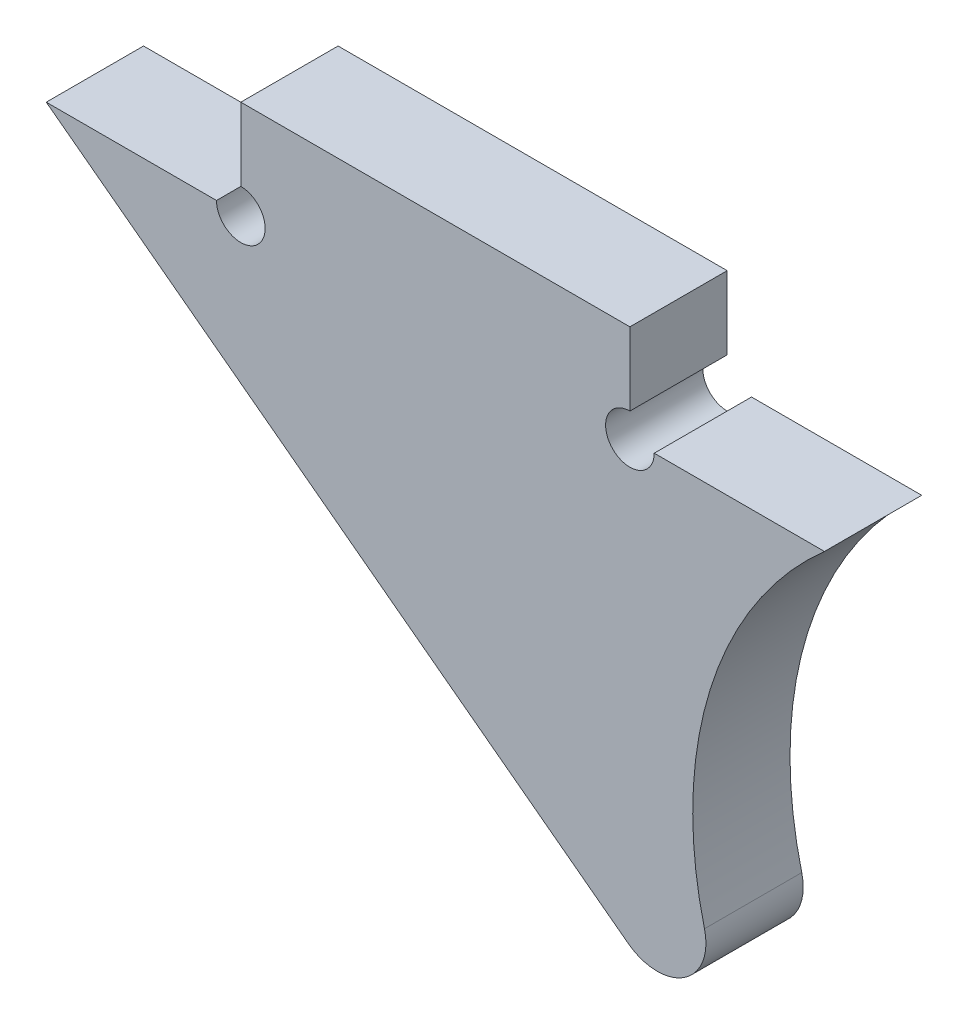
ISO-10303-21;
HEADER;
FILE_DESCRIPTION(('STEP AP214'),'2;1');
FILE_NAME('part.step','',(''),(''),'','','');
FILE_SCHEMA(('AUTOMOTIVE_DESIGN { 1 0 10303 214 1 1 1 1 }'));
ENDSEC;
DATA;
#1=APPLICATION_CONTEXT('core data for automotive mechanical design processes');
#2=APPLICATION_PROTOCOL_DEFINITION('international standard','automotive_design',2000,#1);
#3=PRODUCT_CONTEXT('',#1,'mechanical');
#4=PRODUCT('Part','Part','',(#3));
#5=PRODUCT_RELATED_PRODUCT_CATEGORY('part','',(#4));
#6=PRODUCT_DEFINITION_FORMATION('','',#4);
#7=PRODUCT_DEFINITION_CONTEXT('part definition',#1,'design');
#8=PRODUCT_DEFINITION('design','',#6,#7);
#9=PRODUCT_DEFINITION_SHAPE('','',#8);
#10=(LENGTH_UNIT() NAMED_UNIT(*) SI_UNIT(.MILLI.,.METRE.));
#11=(NAMED_UNIT(*) PLANE_ANGLE_UNIT() SI_UNIT($,.RADIAN.));
#12=(NAMED_UNIT(*) SI_UNIT($,.STERADIAN.) SOLID_ANGLE_UNIT());
#13=UNCERTAINTY_MEASURE_WITH_UNIT(LENGTH_MEASURE(1.E-05),#10,'distance_accuracy_value','');
#14=(GEOMETRIC_REPRESENTATION_CONTEXT(3) GLOBAL_UNCERTAINTY_ASSIGNED_CONTEXT((#13)) GLOBAL_UNIT_ASSIGNED_CONTEXT((#10,
#11,#12)) REPRESENTATION_CONTEXT('',''));
#15=CARTESIAN_POINT('',(0.,0.,0.));
#16=DIRECTION('',(0.,0.,1.));
#17=DIRECTION('',(1.,0.,0.));
#18=AXIS2_PLACEMENT_3D('',#15,#16,#17);
#19=CARTESIAN_POINT('',(-6.35000000000017,0.,37.9156776553178));
#20=DIRECTION('',(-1.,0.,0.));
#21=DIRECTION('',(0.,0.,1.));
#22=AXIS2_PLACEMENT_3D('',#19,#20,#21);
#23=PLANE('',#22);
#24=DIRECTION('',(0.,1.,0.));
#25=VECTOR('',#24,1.);
#26=CARTESIAN_POINT('',(-6.35000000000017,0.,3.17499999999998));
#27=LINE('',#26,#25);
#28=CARTESIAN_POINT('',(-6.35000000000017,0.79375,3.17499999999998));
#29=VERTEX_POINT('',#28);
#30=CARTESIAN_POINT('',(-6.35000000000017,3.175,3.17499999999999));
#31=VERTEX_POINT('',#30);
#32=EDGE_CURVE('E133',#29,#31,#27,.T.);
#33=ORIENTED_EDGE('',*,*,#32,.F.);
#34=DIRECTION('',(0.,0.,1.));
#35=VECTOR('',#34,1.);
#36=CARTESIAN_POINT('',(-6.35000000000017,0.79375,-2.24506403026729));
#37=LINE('',#36,#35);
#38=CARTESIAN_POINT('',(-6.35000000000017,0.79375,0.));
#39=VERTEX_POINT('',#38);
#40=EDGE_CURVE('E55',#29,#39,#37,.F.);
#41=ORIENTED_EDGE('',*,*,#40,.T.);
#42=DIRECTION('',(0.,1.,0.));
#43=VECTOR('',#42,1.);
#44=CARTESIAN_POINT('',(-6.35000000000017,0.,0.));
#45=LINE('',#44,#43);
#46=CARTESIAN_POINT('',(-6.35000000000017,3.175,0.));
#47=VERTEX_POINT('',#46);
#48=EDGE_CURVE('E125',#39,#47,#45,.T.);
#49=ORIENTED_EDGE('',*,*,#48,.T.);
#50=DIRECTION('',(0.,0.,-1.));
#51=VECTOR('',#50,1.);
#52=CARTESIAN_POINT('',(-6.35000000000017,3.175,37.9156776553178));
#53=LINE('',#52,#51);
#54=EDGE_CURVE('E155',#31,#47,#53,.T.);
#55=ORIENTED_EDGE('',*,*,#54,.F.);
#56=EDGE_LOOP('',(#33,#41,#49,#55));
#57=FACE_BOUND('',#56,.T.);
#58=ADVANCED_FACE('F33',(#57),#23,.F.);
#59=CARTESIAN_POINT('',(-6.35000000000017,3.175,37.9156776553178));
#60=DIRECTION('',(0.,-1.,0.));
#61=DIRECTION('',(0.,0.,-1.));
#62=AXIS2_PLACEMENT_3D('',#59,#60,#61);
#63=PLANE('',#62);
#64=DIRECTION('',(-1.,0.,0.));
#65=VECTOR('',#64,1.);
#66=CARTESIAN_POINT('',(-6.35000000000021,3.175,3.17499999999998));
#67=LINE('',#66,#65);
#68=CARTESIAN_POINT('',(-19.0500000000002,3.175,3.175));
#69=VERTEX_POINT('',#68);
#70=EDGE_CURVE('E168',#31,#69,#67,.T.);
#71=ORIENTED_EDGE('',*,*,#70,.F.);
#72=ORIENTED_EDGE('',*,*,#54,.T.);
#73=DIRECTION('',(-1.,0.,0.));
#74=VECTOR('',#73,1.);
#75=CARTESIAN_POINT('',(-6.35000000000017,3.175,0.));
#76=LINE('',#75,#74);
#77=CARTESIAN_POINT('',(-19.0500000000002,3.175,0.));
#78=VERTEX_POINT('',#77);
#79=EDGE_CURVE('E152',#47,#78,#76,.T.);
#80=ORIENTED_EDGE('',*,*,#79,.T.);
#81=DIRECTION('',(0.,0.,-1.));
#82=VECTOR('',#81,1.);
#83=CARTESIAN_POINT('',(-19.0500000000002,3.175,37.9156776553178));
#84=LINE('',#83,#82);
#85=EDGE_CURVE('E151',#69,#78,#84,.T.);
#86=ORIENTED_EDGE('',*,*,#85,.F.);
#87=EDGE_LOOP('',(#71,#72,#80,#86));
#88=FACE_BOUND('',#87,.T.);
#89=ADVANCED_FACE('F210',(#88),#63,.F.);
#90=CARTESIAN_POINT('',(-19.0500000000002,3.175,37.9156776553178));
#91=DIRECTION('',(1.,0.,0.));
#92=DIRECTION('',(0.,0.,-1.));
#93=AXIS2_PLACEMENT_3D('',#90,#91,#92);
#94=PLANE('',#93);
#95=DIRECTION('',(0.,-1.,0.));
#96=VECTOR('',#95,1.);
#97=CARTESIAN_POINT('',(-19.0500000000002,3.175,0.));
#98=LINE('',#97,#96);
#99=CARTESIAN_POINT('',(-19.0500000000002,0.793749999999999,0.));
#100=VERTEX_POINT('',#99);
#101=EDGE_CURVE('E148',#78,#100,#98,.T.);
#102=ORIENTED_EDGE('',*,*,#101,.T.);
#103=DIRECTION('',(0.,0.,1.));
#104=VECTOR('',#103,1.);
#105=CARTESIAN_POINT('',(-19.0500000000002,0.793749999999999,-2.24506403026729));
#106=LINE('',#105,#104);
#107=CARTESIAN_POINT('',(-19.0500000000002,0.793749999999999,3.17499999999998));
#108=VERTEX_POINT('',#107);
#109=EDGE_CURVE('E139',#100,#108,#106,.T.);
#110=ORIENTED_EDGE('',*,*,#109,.T.);
#111=DIRECTION('',(0.,-1.,0.));
#112=VECTOR('',#111,1.);
#113=CARTESIAN_POINT('',(-19.0500000000002,3.175,3.175));
#114=LINE('',#113,#112);
#115=EDGE_CURVE('E165',#69,#108,#114,.T.);
#116=ORIENTED_EDGE('',*,*,#115,.F.);
#117=ORIENTED_EDGE('',*,*,#85,.T.);
#118=EDGE_LOOP('',(#102,#110,#116,#117));
#119=FACE_BOUND('',#118,.T.);
#120=ADVANCED_FACE('F206',(#119),#94,.F.);
#121=CARTESIAN_POINT('',(-19.0500000000002,0.,37.9156776553178));
#122=DIRECTION('',(0.,-1.,0.));
#123=DIRECTION('',(0.,0.,-1.));
#124=AXIS2_PLACEMENT_3D('',#121,#122,#123);
#125=PLANE('',#124);
#126=DIRECTION('',(-1.,0.,0.));
#127=VECTOR('',#126,1.);
#128=CARTESIAN_POINT('',(-19.0500000000002,0.,3.175));
#129=LINE('',#128,#127);
#130=CARTESIAN_POINT('',(-19.8437500000002,0.,3.175));
#131=VERTEX_POINT('',#130);
#132=CARTESIAN_POINT('',(-25.4000000000002,0.,3.17499999999999));
#133=VERTEX_POINT('',#132);
#134=EDGE_CURVE('E163',#131,#133,#129,.T.);
#135=ORIENTED_EDGE('',*,*,#134,.F.);
#136=DIRECTION('',(0.,0.,1.));
#137=VECTOR('',#136,1.);
#138=CARTESIAN_POINT('',(-19.8437500000002,0.,-2.24506403026729));
#139=LINE('',#138,#137);
#140=CARTESIAN_POINT('',(-19.8437500000002,0.,0.));
#141=VERTEX_POINT('',#140);
#142=EDGE_CURVE('E47',#131,#141,#139,.F.);
#143=ORIENTED_EDGE('',*,*,#142,.T.);
#144=DIRECTION('',(-1.,0.,0.));
#145=VECTOR('',#144,1.);
#146=CARTESIAN_POINT('',(-19.0500000000002,0.,0.));
#147=LINE('',#146,#145);
#148=CARTESIAN_POINT('',(-25.4000000000002,0.,0.));
#149=VERTEX_POINT('',#148);
#150=EDGE_CURVE('E146',#141,#149,#147,.T.);
#151=ORIENTED_EDGE('',*,*,#150,.T.);
#152=DIRECTION('',(0.,0.,-1.));
#153=VECTOR('',#152,1.);
#154=CARTESIAN_POINT('',(-25.4000000000002,0.,37.9156776553178));
#155=LINE('',#154,#153);
#156=EDGE_CURVE('E145',#133,#149,#155,.T.);
#157=ORIENTED_EDGE('',*,*,#156,.F.);
#158=EDGE_LOOP('',(#135,#143,#151,#157));
#159=FACE_BOUND('',#158,.T.);
#160=ADVANCED_FACE('F200',(#159),#125,.F.);
#161=CARTESIAN_POINT('',(-25.4000000000002,0.,37.9156776553178));
#162=DIRECTION('',(0.600972912504589,0.799269390403356,0.));
#163=DIRECTION('',(-0.799269390403356,0.600972912504589,0.));
#164=AXIS2_PLACEMENT_3D('',#161,#162,#163);
#165=PLANE('',#164);
#166=DIRECTION('',(0.799269390403356,-0.600972912504589,0.));
#167=VECTOR('',#166,1.);
#168=CARTESIAN_POINT('',(-25.4000000000002,0.,0.));
#169=LINE('',#168,#167);
#170=CARTESIAN_POINT('',(-6.40973941173114,-14.2788305820065,0.));
#171=VERTEX_POINT('',#170);
#172=EDGE_CURVE('E142',#149,#171,#169,.T.);
#173=ORIENTED_EDGE('',*,*,#172,.T.);
#174=DIRECTION('',(0.,0.,-1.));
#175=VECTOR('',#174,1.);
#176=CARTESIAN_POINT('',(-6.40973941173115,-14.2788305820065,37.9156776553178));
#177=LINE('',#176,#175);
#178=CARTESIAN_POINT('',(-6.40973941173115,-14.2788305820065,3.17499999999998));
#179=VERTEX_POINT('',#178);
#180=EDGE_CURVE('E181',#171,#179,#177,.F.);
#181=ORIENTED_EDGE('',*,*,#180,.T.);
#182=DIRECTION('',(0.799269390403356,-0.600972912504589,0.));
#183=VECTOR('',#182,1.);
#184=CARTESIAN_POINT('',(-25.4000000000002,0.,3.175));
#185=LINE('',#184,#183);
#186=EDGE_CURVE('E160',#133,#179,#185,.T.);
#187=ORIENTED_EDGE('',*,*,#186,.F.);
#188=ORIENTED_EDGE('',*,*,#156,.T.);
#189=EDGE_LOOP('',(#173,#181,#187,#188));
#190=FACE_BOUND('',#189,.T.);
#191=ADVANCED_FACE('F196',(#190),#165,.F.);
#192=CARTESIAN_POINT('',(8.40026041263008,-9.525,37.9156776553178));
#193=DIRECTION('',(0.,0.,-1.));
#194=DIRECTION('',(-1.,0.,0.));
#195=AXIS2_PLACEMENT_3D('',#192,#193,#194);
#196=CYLINDRICAL_SURFACE('',#195,12.7);
#197=CARTESIAN_POINT('',(8.40026041263008,-9.525,3.17499999999997));
#198=DIRECTION('',(0.,0.,1.));
#199=DIRECTION('',(1.,0.,0.));
#200=AXIS2_PLACEMENT_3D('',#197,#198,#199);
#201=CIRCLE('',#200,12.7);
#202=CARTESIAN_POINT('',(-3.91614432137898,-12.6227692664366,3.17499999999998));
#203=VERTEX_POINT('',#202);
#204=CARTESIAN_POINT('',(0.,0.,3.17499999999998));
#205=VERTEX_POINT('',#204);
#206=EDGE_CURVE('E157',#203,#205,#201,.F.);
#207=ORIENTED_EDGE('',*,*,#206,.F.);
#208=DIRECTION('',(0.,0.,-1.));
#209=VECTOR('',#208,1.);
#210=CARTESIAN_POINT('',(-3.91614432137898,-12.6227692664366,37.9156776553178));
#211=LINE('',#210,#209);
#212=CARTESIAN_POINT('',(-3.91614432137898,-12.6227692664366,0.));
#213=VERTEX_POINT('',#212);
#214=EDGE_CURVE('E159',#203,#213,#211,.T.);
#215=ORIENTED_EDGE('',*,*,#214,.T.);
#216=CARTESIAN_POINT('',(8.40026041263008,-9.525,0.));
#217=DIRECTION('',(0.,0.,-1.));
#218=DIRECTION('',(1.,0.,0.));
#219=AXIS2_PLACEMENT_3D('',#216,#217,#218);
#220=CIRCLE('',#219,12.7);
#221=CARTESIAN_POINT('',(0.,0.,0.));
#222=VERTEX_POINT('',#221);
#223=EDGE_CURVE('E135',#213,#222,#220,.T.);
#224=ORIENTED_EDGE('',*,*,#223,.T.);
#225=DIRECTION('',(0.,0.,-1.));
#226=VECTOR('',#225,1.);
#227=CARTESIAN_POINT('',(0.,0.,37.9156776553178));
#228=LINE('',#227,#226);
#229=EDGE_CURVE('E130',#205,#222,#228,.T.);
#230=ORIENTED_EDGE('',*,*,#229,.F.);
#231=EDGE_LOOP('',(#207,#215,#224,#230));
#232=FACE_BOUND('',#231,.T.);
#233=ADVANCED_FACE('F193',(#232),#196,.F.);
#234=CARTESIAN_POINT('',(-6.35000000000017,0.,37.9156776553178));
#235=DIRECTION('',(0.,-1.,0.));
#236=DIRECTION('',(0.,0.,-1.));
#237=AXIS2_PLACEMENT_3D('',#234,#235,#236);
#238=PLANE('',#237);
#239=DIRECTION('',(-1.,0.,0.));
#240=VECTOR('',#239,1.);
#241=CARTESIAN_POINT('',(-6.35000000000017,0.,0.));
#242=LINE('',#241,#240);
#243=CARTESIAN_POINT('',(-5.55625000000017,0.,0.));
#244=VERTEX_POINT('',#243);
#245=EDGE_CURVE('E123',#222,#244,#242,.T.);
#246=ORIENTED_EDGE('',*,*,#245,.T.);
#247=DIRECTION('',(0.,0.,1.));
#248=VECTOR('',#247,1.);
#249=CARTESIAN_POINT('',(-5.55625000000017,0.,-2.24506403026729));
#250=LINE('',#249,#248);
#251=CARTESIAN_POINT('',(-5.55625000000017,0.,3.17499999999998));
#252=VERTEX_POINT('',#251);
#253=EDGE_CURVE('E107',#244,#252,#250,.T.);
#254=ORIENTED_EDGE('',*,*,#253,.T.);
#255=DIRECTION('',(-1.,0.,0.));
#256=VECTOR('',#255,1.);
#257=CARTESIAN_POINT('',(-6.35000000000021,0.,3.17499999999998));
#258=LINE('',#257,#256);
#259=EDGE_CURVE('E131',#205,#252,#258,.T.);
#260=ORIENTED_EDGE('',*,*,#259,.F.);
#261=ORIENTED_EDGE('',*,*,#229,.T.);
#262=EDGE_LOOP('',(#246,#254,#260,#261));
#263=FACE_BOUND('',#262,.T.);
#264=ADVANCED_FACE('F128',(#263),#238,.F.);
#265=CARTESIAN_POINT('',(8.40026041263008,-9.525,0.));
#266=DIRECTION('',(0.,0.,1.));
#267=DIRECTION('',(1.,0.,0.));
#268=AXIS2_PLACEMENT_3D('',#265,#266,#267);
#269=PLANE('',#268);
#270=ORIENTED_EDGE('',*,*,#150,.F.);
#271=CARTESIAN_POINT('',(-19.0500000000002,0.,0.));
#272=DIRECTION('',(0.,0.,1.));
#273=DIRECTION('',(1.,0.,0.));
#274=AXIS2_PLACEMENT_3D('',#271,#272,#273);
#275=CIRCLE('',#274,0.793749999999999);
#276=EDGE_CURVE('E115',#100,#141,#275,.F.);
#277=ORIENTED_EDGE('',*,*,#276,.F.);
#278=ORIENTED_EDGE('',*,*,#101,.F.);
#279=ORIENTED_EDGE('',*,*,#79,.F.);
#280=ORIENTED_EDGE('',*,*,#48,.F.);
#281=CARTESIAN_POINT('',(-6.35000000000017,0.,0.));
#282=DIRECTION('',(0.,0.,1.));
#283=DIRECTION('',(1.,0.,0.));
#284=AXIS2_PLACEMENT_3D('',#281,#282,#283);
#285=CIRCLE('',#284,0.79375);
#286=EDGE_CURVE('E110',#244,#39,#285,.F.);
#287=ORIENTED_EDGE('',*,*,#286,.F.);
#288=ORIENTED_EDGE('',*,*,#245,.F.);
#289=ORIENTED_EDGE('',*,*,#223,.F.);
#290=CARTESIAN_POINT('',(-5.45569491313011,-13.0099904247412,0.));
#291=DIRECTION('',(0.,0.,1.));
#292=DIRECTION('',(1.,0.,0.));
#293=AXIS2_PLACEMENT_3D('',#290,#291,#292);
#294=CIRCLE('',#293,1.5875);
#295=EDGE_CURVE('E179',#213,#171,#294,.F.);
#296=ORIENTED_EDGE('',*,*,#295,.T.);
#297=ORIENTED_EDGE('',*,*,#172,.F.);
#298=EDGE_LOOP('',(#270,#277,#278,#279,#280,#287,#288,#289,#296,#297));
#299=FACE_BOUND('',#298,.T.);
#300=ADVANCED_FACE('F121',(#299),#269,.F.);
#301=CARTESIAN_POINT('',(-19.0500000000001,0.,3.175));
#302=DIRECTION('',(0.,0.,1.));
#303=DIRECTION('',(1.,0.,0.));
#304=AXIS2_PLACEMENT_3D('',#301,#302,#303);
#305=PLANE('',#304);
#306=CARTESIAN_POINT('',(-19.0500000000002,0.,3.175));
#307=DIRECTION('',(0.,0.,1.));
#308=DIRECTION('',(1.,0.,0.));
#309=AXIS2_PLACEMENT_3D('',#306,#307,#308);
#310=CIRCLE('',#309,0.793749999999999);
#311=EDGE_CURVE('E11',#131,#108,#310,.T.);
#312=ORIENTED_EDGE('',*,*,#311,.F.);
#313=ORIENTED_EDGE('',*,*,#134,.T.);
#314=ORIENTED_EDGE('',*,*,#186,.T.);
#315=CARTESIAN_POINT('',(-5.45569491313011,-13.0099904247412,3.17499999999998));
#316=DIRECTION('',(0.,0.,1.));
#317=DIRECTION('',(1.,0.,0.));
#318=AXIS2_PLACEMENT_3D('',#315,#316,#317);
#319=CIRCLE('',#318,1.5875);
#320=EDGE_CURVE('E183',#179,#203,#319,.T.);
#321=ORIENTED_EDGE('',*,*,#320,.T.);
#322=ORIENTED_EDGE('',*,*,#206,.T.);
#323=ORIENTED_EDGE('',*,*,#259,.T.);
#324=CARTESIAN_POINT('',(-6.35000000000017,0.,3.17499999999998));
#325=DIRECTION('',(0.,0.,1.));
#326=DIRECTION('',(1.,0.,0.));
#327=AXIS2_PLACEMENT_3D('',#324,#325,#326);
#328=CIRCLE('',#327,0.79375);
#329=EDGE_CURVE('E41',#29,#252,#328,.T.);
#330=ORIENTED_EDGE('',*,*,#329,.F.);
#331=ORIENTED_EDGE('',*,*,#32,.T.);
#332=ORIENTED_EDGE('',*,*,#70,.T.);
#333=ORIENTED_EDGE('',*,*,#115,.T.);
#334=EDGE_LOOP('',(#312,#313,#314,#321,#322,#323,#330,#331,#332,#333));
#335=FACE_BOUND('',#334,.T.);
#336=ADVANCED_FACE('F187',(#335),#305,.T.);
#337=CARTESIAN_POINT('',(-5.45569491313011,-13.0099904247412,37.9156776553178));
#338=DIRECTION('',(0.,0.,-1.));
#339=DIRECTION('',(-1.,0.,0.));
#340=AXIS2_PLACEMENT_3D('',#337,#338,#339);
#341=CYLINDRICAL_SURFACE('',#340,1.5875);
#342=ORIENTED_EDGE('',*,*,#320,.F.);
#343=ORIENTED_EDGE('',*,*,#180,.F.);
#344=ORIENTED_EDGE('',*,*,#295,.F.);
#345=ORIENTED_EDGE('',*,*,#214,.F.);
#346=EDGE_LOOP('',(#342,#343,#344,#345));
#347=FACE_BOUND('',#346,.T.);
#348=ADVANCED_FACE('F35',(#347),#341,.T.);
#349=CARTESIAN_POINT('',(-6.35000000000017,0.,-2.24506403026729));
#350=DIRECTION('',(0.,0.,1.));
#351=DIRECTION('',(1.,0.,0.));
#352=AXIS2_PLACEMENT_3D('',#349,#350,#351);
#353=CYLINDRICAL_SURFACE('',#352,0.79375);
#354=ORIENTED_EDGE('',*,*,#329,.T.);
#355=ORIENTED_EDGE('',*,*,#253,.F.);
#356=ORIENTED_EDGE('',*,*,#286,.T.);
#357=ORIENTED_EDGE('',*,*,#40,.F.);
#358=EDGE_LOOP('',(#354,#355,#356,#357));
#359=FACE_BOUND('',#358,.T.);
#360=ADVANCED_FACE('F109',(#359),#353,.F.);
#361=CARTESIAN_POINT('',(-19.0500000000002,0.,-2.24506403026729));
#362=DIRECTION('',(0.,0.,1.));
#363=DIRECTION('',(1.,0.,0.));
#364=AXIS2_PLACEMENT_3D('',#361,#362,#363);
#365=CYLINDRICAL_SURFACE('',#364,0.793749999999999);
#366=ORIENTED_EDGE('',*,*,#276,.T.);
#367=ORIENTED_EDGE('',*,*,#142,.F.);
#368=ORIENTED_EDGE('',*,*,#311,.T.);
#369=ORIENTED_EDGE('',*,*,#109,.F.);
#370=EDGE_LOOP('',(#366,#367,#368,#369));
#371=FACE_BOUND('',#370,.T.);
#372=ADVANCED_FACE('F215',(#371),#365,.F.);
#373=CLOSED_SHELL('',(#58,#89,#120,#160,#191,#233,#264,#300,#336,#348,#360,#372));
#374=MANIFOLD_SOLID_BREP('B2',#373);
#375=ADVANCED_BREP_SHAPE_REPRESENTATION('',(#18,#374),#14);
#376=SHAPE_DEFINITION_REPRESENTATION(#9,#375);
ENDSEC;
END-ISO-10303-21;
